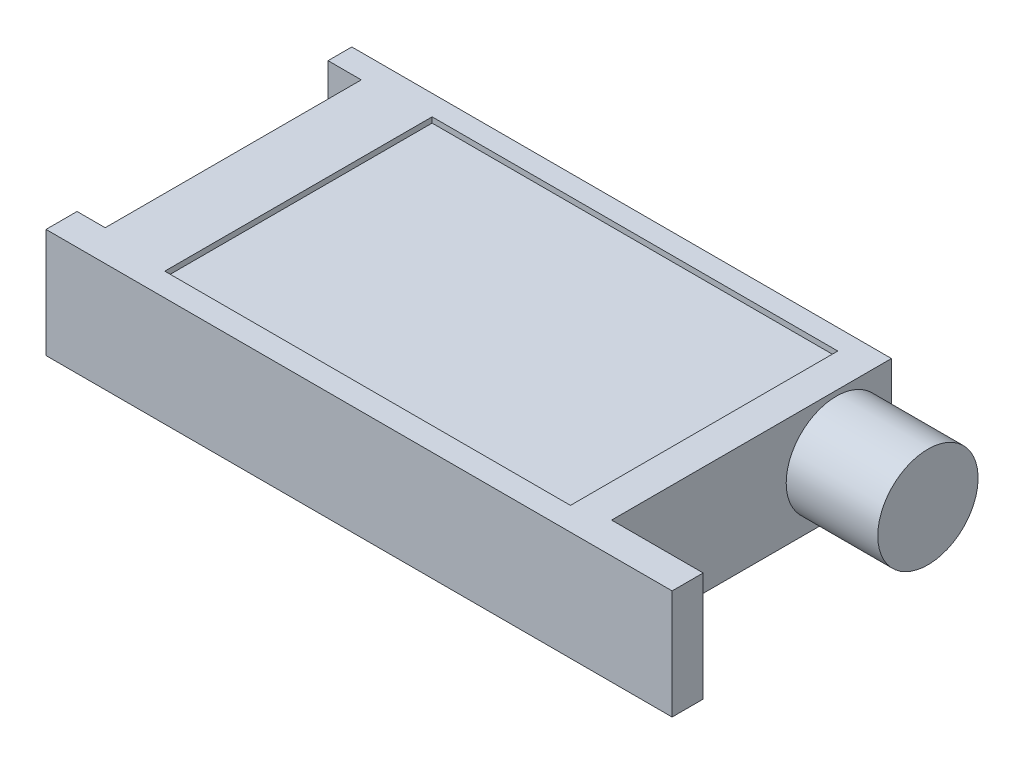
ISO-10303-21;
HEADER;
FILE_DESCRIPTION(('STEP AP214'),'2;1');
FILE_NAME('part.step','',(''),(''),'','','');
FILE_SCHEMA(('AUTOMOTIVE_DESIGN { 1 0 10303 214 1 1 1 1 }'));
ENDSEC;
DATA;
#1=APPLICATION_CONTEXT('core data for automotive mechanical design processes');
#2=APPLICATION_PROTOCOL_DEFINITION('international standard','automotive_design',2000,#1);
#3=PRODUCT_CONTEXT('',#1,'mechanical');
#4=PRODUCT('Part','Part','',(#3));
#5=PRODUCT_RELATED_PRODUCT_CATEGORY('part','',(#4));
#6=PRODUCT_DEFINITION_FORMATION('','',#4);
#7=PRODUCT_DEFINITION_CONTEXT('part definition',#1,'design');
#8=PRODUCT_DEFINITION('design','',#6,#7);
#9=PRODUCT_DEFINITION_SHAPE('','',#8);
#10=(LENGTH_UNIT() NAMED_UNIT(*) SI_UNIT(.MILLI.,.METRE.));
#11=(NAMED_UNIT(*) PLANE_ANGLE_UNIT() SI_UNIT($,.RADIAN.));
#12=(NAMED_UNIT(*) SI_UNIT($,.STERADIAN.) SOLID_ANGLE_UNIT());
#13=UNCERTAINTY_MEASURE_WITH_UNIT(LENGTH_MEASURE(1.E-05),#10,'distance_accuracy_value','');
#14=(GEOMETRIC_REPRESENTATION_CONTEXT(3) GLOBAL_UNCERTAINTY_ASSIGNED_CONTEXT((#13)) GLOBAL_UNIT_ASSIGNED_CONTEXT((#10,
#11,#12)) REPRESENTATION_CONTEXT('',''));
#15=CARTESIAN_POINT('',(0.,0.,0.));
#16=DIRECTION('',(0.,0.,1.));
#17=DIRECTION('',(1.,0.,0.));
#18=AXIS2_PLACEMENT_3D('',#15,#16,#17);
#19=CARTESIAN_POINT('',(42.6292577103097,20.,-25.999180786485));
#20=DIRECTION('',(-1.,0.,0.));
#21=DIRECTION('',(0.,0.,1.));
#22=AXIS2_PLACEMENT_3D('',#19,#20,#21);
#23=PLANE('',#22);
#24=DIRECTION('',(0.,0.,-1.));
#25=VECTOR('',#24,1.);
#26=CARTESIAN_POINT('',(42.6292577103097,0.,-25.999180786485));
#27=LINE('',#26,#25);
#28=CARTESIAN_POINT('',(42.6292577103097,0.,25.2261799674478));
#29=VERTEX_POINT('',#28);
#30=CARTESIAN_POINT('',(42.6292577103097,0.,-25.999180786485));
#31=VERTEX_POINT('',#30);
#32=EDGE_CURVE('E98',#29,#31,#27,.T.);
#33=ORIENTED_EDGE('',*,*,#32,.T.);
#34=DIRECTION('',(0.,-1.,0.));
#35=VECTOR('',#34,1.);
#36=CARTESIAN_POINT('',(42.6292577103097,20.,-25.999180786485));
#37=LINE('',#36,#35);
#38=CARTESIAN_POINT('',(42.6292577103097,20.,-25.999180786485));
#39=VERTEX_POINT('',#38);
#40=EDGE_CURVE('E155',#39,#31,#37,.T.);
#41=ORIENTED_EDGE('',*,*,#40,.F.);
#42=DIRECTION('',(0.,0.,-1.));
#43=VECTOR('',#42,1.);
#44=CARTESIAN_POINT('',(42.6292577103097,20.,-25.999180786485));
#45=LINE('',#44,#43);
#46=CARTESIAN_POINT('',(42.6292577103097,20.,25.2261799674478));
#47=VERTEX_POINT('',#46);
#48=EDGE_CURVE('E153',#47,#39,#45,.T.);
#49=ORIENTED_EDGE('',*,*,#48,.F.);
#50=DIRECTION('',(0.,-1.,0.));
#51=VECTOR('',#50,1.);
#52=CARTESIAN_POINT('',(42.6292577103097,20.,25.2261799674478));
#53=LINE('',#52,#51);
#54=EDGE_CURVE('E149',#47,#29,#53,.T.);
#55=ORIENTED_EDGE('',*,*,#54,.T.);
#56=EDGE_LOOP('',(#33,#41,#49,#55));
#57=FACE_BOUND('',#56,.T.);
#58=CARTESIAN_POINT('',(42.6292577103097,9.88869004447679,-15.9112823228043));
#59=DIRECTION('',(-1.,0.,0.));
#60=DIRECTION('',(0.,0.,1.));
#61=AXIS2_PLACEMENT_3D('',#58,#59,#60);
#62=CIRCLE('',#61,9.1809488573834);
#63=CARTESIAN_POINT('',(42.6292577103097,9.88869004447679,-6.73033346542085));
#64=VERTEX_POINT('',#63);
#65=EDGE_CURVE('E11',#64,#64,#62,.F.);
#66=ORIENTED_EDGE('',*,*,#65,.F.);
#67=EDGE_LOOP('',(#66));
#68=FACE_BOUND('',#67,.T.);
#69=ADVANCED_FACE('F33',(#57,#68),#23,.F.);
#70=CARTESIAN_POINT('',(-56.1421612977568,20.,-25.999180786485));
#71=DIRECTION('',(1.,0.,0.));
#72=DIRECTION('',(0.,0.,-1.));
#73=AXIS2_PLACEMENT_3D('',#70,#71,#72);
#74=PLANE('',#73);
#75=DIRECTION('',(0.,0.,1.));
#76=VECTOR('',#75,1.);
#77=CARTESIAN_POINT('',(-56.1421612977568,0.,-25.999180786485));
#78=LINE('',#77,#76);
#79=CARTESIAN_POINT('',(-56.1421612977568,0.,-25.999180786485));
#80=VERTEX_POINT('',#79);
#81=CARTESIAN_POINT('',(-56.1421612977568,0.,-21.6468898956184));
#82=VERTEX_POINT('',#81);
#83=EDGE_CURVE('E159',#80,#82,#78,.T.);
#84=ORIENTED_EDGE('',*,*,#83,.T.);
#85=DIRECTION('',(0.,-1.,0.));
#86=VECTOR('',#85,1.);
#87=CARTESIAN_POINT('',(-56.1421612977568,20.,-21.6468898956184));
#88=LINE('',#87,#86);
#89=CARTESIAN_POINT('',(-56.1421612977568,20.,-21.6468898956184));
#90=VERTEX_POINT('',#89);
#91=EDGE_CURVE('E194',#90,#82,#88,.T.);
#92=ORIENTED_EDGE('',*,*,#91,.F.);
#93=DIRECTION('',(0.,0.,1.));
#94=VECTOR('',#93,1.);
#95=CARTESIAN_POINT('',(-56.1421612977568,20.,-25.999180786485));
#96=LINE('',#95,#94);
#97=CARTESIAN_POINT('',(-56.1421612977568,20.,-25.999180786485));
#98=VERTEX_POINT('',#97);
#99=EDGE_CURVE('E106',#98,#90,#96,.T.);
#100=ORIENTED_EDGE('',*,*,#99,.F.);
#101=DIRECTION('',(0.,-1.,0.));
#102=VECTOR('',#101,1.);
#103=CARTESIAN_POINT('',(-56.1421612977568,20.,-25.999180786485));
#104=LINE('',#103,#102);
#105=EDGE_CURVE('E41',#98,#80,#104,.T.);
#106=ORIENTED_EDGE('',*,*,#105,.T.);
#107=EDGE_LOOP('',(#84,#92,#100,#106));
#108=FACE_BOUND('',#107,.T.);
#109=ADVANCED_FACE('F35',(#108),#74,.F.);
#110=CARTESIAN_POINT('',(-56.1421612977568,20.,-21.6468898956184));
#111=DIRECTION('',(0.,0.,-1.));
#112=DIRECTION('',(-1.,0.,0.));
#113=AXIS2_PLACEMENT_3D('',#110,#111,#112);
#114=PLANE('',#113);
#115=DIRECTION('',(1.,0.,0.));
#116=VECTOR('',#115,1.);
#117=CARTESIAN_POINT('',(-56.1421612977568,0.,-21.6468898956184));
#118=LINE('',#117,#116);
#119=CARTESIAN_POINT('',(-50.0551461637357,0.,-21.6468898956184));
#120=VERTEX_POINT('',#119);
#121=EDGE_CURVE('E161',#82,#120,#118,.T.);
#122=ORIENTED_EDGE('',*,*,#121,.T.);
#123=DIRECTION('',(0.,-1.,0.));
#124=VECTOR('',#123,1.);
#125=CARTESIAN_POINT('',(-50.0551461637357,20.,-21.6468898956184));
#126=LINE('',#125,#124);
#127=CARTESIAN_POINT('',(-50.0551461637357,20.,-21.6468898956184));
#128=VERTEX_POINT('',#127);
#129=EDGE_CURVE('E191',#128,#120,#126,.T.);
#130=ORIENTED_EDGE('',*,*,#129,.F.);
#131=DIRECTION('',(1.,0.,0.));
#132=VECTOR('',#131,1.);
#133=CARTESIAN_POINT('',(-56.1421612977568,20.,-21.6468898956184));
#134=LINE('',#133,#132);
#135=EDGE_CURVE('E215',#90,#128,#134,.T.);
#136=ORIENTED_EDGE('',*,*,#135,.F.);
#137=ORIENTED_EDGE('',*,*,#91,.T.);
#138=EDGE_LOOP('',(#122,#130,#136,#137));
#139=FACE_BOUND('',#138,.T.);
#140=ADVANCED_FACE('F206',(#139),#114,.F.);
#141=CARTESIAN_POINT('',(-50.0551461637357,20.,-21.6468898956184));
#142=DIRECTION('',(1.,0.,0.));
#143=DIRECTION('',(0.,0.,-1.));
#144=AXIS2_PLACEMENT_3D('',#141,#142,#143);
#145=PLANE('',#144);
#146=DIRECTION('',(0.,0.,1.));
#147=VECTOR('',#146,1.);
#148=CARTESIAN_POINT('',(-50.0551461637357,0.,-21.6468898956184));
#149=LINE('',#148,#147);
#150=CARTESIAN_POINT('',(-50.0551461637357,0.,25.2261799674478));
#151=VERTEX_POINT('',#150);
#152=EDGE_CURVE('E164',#120,#151,#149,.T.);
#153=ORIENTED_EDGE('',*,*,#152,.T.);
#154=DIRECTION('',(0.,-1.,0.));
#155=VECTOR('',#154,1.);
#156=CARTESIAN_POINT('',(-50.0551461637357,20.,25.2261799674478));
#157=LINE('',#156,#155);
#158=CARTESIAN_POINT('',(-50.0551461637357,20.,25.2261799674478));
#159=VERTEX_POINT('',#158);
#160=EDGE_CURVE('E188',#159,#151,#157,.T.);
#161=ORIENTED_EDGE('',*,*,#160,.F.);
#162=DIRECTION('',(0.,0.,1.));
#163=VECTOR('',#162,1.);
#164=CARTESIAN_POINT('',(-50.0551461637357,20.,-21.6468898956184));
#165=LINE('',#164,#163);
#166=EDGE_CURVE('E212',#128,#159,#165,.T.);
#167=ORIENTED_EDGE('',*,*,#166,.F.);
#168=ORIENTED_EDGE('',*,*,#129,.T.);
#169=EDGE_LOOP('',(#153,#161,#167,#168));
#170=FACE_BOUND('',#169,.T.);
#171=ADVANCED_FACE('F210',(#170),#145,.F.);
#172=CARTESIAN_POINT('',(-55.206550944412,20.,25.2261799674478));
#173=DIRECTION('',(0.,0.,1.));
#174=DIRECTION('',(1.,0.,0.));
#175=AXIS2_PLACEMENT_3D('',#172,#173,#174);
#176=PLANE('',#175);
#177=DIRECTION('',(-1.,0.,0.));
#178=VECTOR('',#177,1.);
#179=CARTESIAN_POINT('',(-55.206550944412,0.,25.2261799674478));
#180=LINE('',#179,#178);
#181=CARTESIAN_POINT('',(-55.206550944412,0.,25.2261799674478));
#182=VERTEX_POINT('',#181);
#183=EDGE_CURVE('E166',#151,#182,#180,.T.);
#184=ORIENTED_EDGE('',*,*,#183,.T.);
#185=DIRECTION('',(0.,-1.,0.));
#186=VECTOR('',#185,1.);
#187=CARTESIAN_POINT('',(-55.206550944412,20.,25.2261799674478));
#188=LINE('',#187,#186);
#189=CARTESIAN_POINT('',(-55.206550944412,20.,25.2261799674478));
#190=VERTEX_POINT('',#189);
#191=EDGE_CURVE('E185',#190,#182,#188,.T.);
#192=ORIENTED_EDGE('',*,*,#191,.F.);
#193=DIRECTION('',(-1.,0.,0.));
#194=VECTOR('',#193,1.);
#195=CARTESIAN_POINT('',(-55.206550944412,20.,25.2261799674478));
#196=LINE('',#195,#194);
#197=EDGE_CURVE('E214',#159,#190,#196,.T.);
#198=ORIENTED_EDGE('',*,*,#197,.F.);
#199=ORIENTED_EDGE('',*,*,#160,.T.);
#200=EDGE_LOOP('',(#184,#192,#198,#199));
#201=FACE_BOUND('',#200,.T.);
#202=ADVANCED_FACE('F321',(#201),#176,.F.);
#203=CARTESIAN_POINT('',(-55.206550944412,20.,30.9105426141656));
#204=DIRECTION('',(1.,0.,0.));
#205=DIRECTION('',(0.,0.,-1.));
#206=AXIS2_PLACEMENT_3D('',#203,#204,#205);
#207=PLANE('',#206);
#208=DIRECTION('',(0.,0.,1.));
#209=VECTOR('',#208,1.);
#210=CARTESIAN_POINT('',(-55.206550944412,0.,30.9105426141656));
#211=LINE('',#210,#209);
#212=CARTESIAN_POINT('',(-55.206550944412,0.,30.9105426141656));
#213=VERTEX_POINT('',#212);
#214=EDGE_CURVE('E168',#182,#213,#211,.T.);
#215=ORIENTED_EDGE('',*,*,#214,.T.);
#216=DIRECTION('',(0.,-1.,0.));
#217=VECTOR('',#216,1.);
#218=CARTESIAN_POINT('',(-55.206550944412,20.,30.9105426141656));
#219=LINE('',#218,#217);
#220=CARTESIAN_POINT('',(-55.206550944412,20.,30.9105426141656));
#221=VERTEX_POINT('',#220);
#222=EDGE_CURVE('E182',#221,#213,#219,.T.);
#223=ORIENTED_EDGE('',*,*,#222,.F.);
#224=DIRECTION('',(0.,0.,1.));
#225=VECTOR('',#224,1.);
#226=CARTESIAN_POINT('',(-55.206550944412,20.,30.9105426141656));
#227=LINE('',#226,#225);
#228=EDGE_CURVE('E217',#190,#221,#227,.T.);
#229=ORIENTED_EDGE('',*,*,#228,.F.);
#230=ORIENTED_EDGE('',*,*,#191,.T.);
#231=EDGE_LOOP('',(#215,#223,#229,#230));
#232=FACE_BOUND('',#231,.T.);
#233=ADVANCED_FACE('F226',(#232),#207,.F.);
#234=CARTESIAN_POINT('',(59.3918124957771,20.,30.9105426141656));
#235=DIRECTION('',(0.,0.,-1.));
#236=DIRECTION('',(-1.,0.,0.));
#237=AXIS2_PLACEMENT_3D('',#234,#235,#236);
#238=PLANE('',#237);
#239=DIRECTION('',(1.,0.,0.));
#240=VECTOR('',#239,1.);
#241=CARTESIAN_POINT('',(59.3918124957771,0.,30.9105426141656));
#242=LINE('',#241,#240);
#243=CARTESIAN_POINT('',(59.3918124957771,0.,30.9105426141656));
#244=VERTEX_POINT('',#243);
#245=EDGE_CURVE('E171',#213,#244,#242,.T.);
#246=ORIENTED_EDGE('',*,*,#245,.T.);
#247=DIRECTION('',(0.,-1.,0.));
#248=VECTOR('',#247,1.);
#249=CARTESIAN_POINT('',(59.3918124957771,20.,30.9105426141656));
#250=LINE('',#249,#248);
#251=CARTESIAN_POINT('',(59.3918124957771,20.,30.9105426141656));
#252=VERTEX_POINT('',#251);
#253=EDGE_CURVE('E148',#252,#244,#250,.T.);
#254=ORIENTED_EDGE('',*,*,#253,.F.);
#255=DIRECTION('',(1.,0.,0.));
#256=VECTOR('',#255,1.);
#257=CARTESIAN_POINT('',(-31.6218630620355,20.,30.9105426141656));
#258=LINE('',#257,#256);
#259=EDGE_CURVE('E136',#221,#252,#258,.T.);
#260=ORIENTED_EDGE('',*,*,#259,.F.);
#261=ORIENTED_EDGE('',*,*,#222,.T.);
#262=EDGE_LOOP('',(#246,#254,#260,#261));
#263=FACE_BOUND('',#262,.T.);
#264=ADVANCED_FACE('F229',(#263),#238,.F.);
#265=CARTESIAN_POINT('',(59.3918124957771,20.,25.2261799674478));
#266=DIRECTION('',(-1.,0.,0.));
#267=DIRECTION('',(0.,0.,1.));
#268=AXIS2_PLACEMENT_3D('',#265,#266,#267);
#269=PLANE('',#268);
#270=DIRECTION('',(0.,0.,-1.));
#271=VECTOR('',#270,1.);
#272=CARTESIAN_POINT('',(59.3918124957771,0.,25.2261799674478));
#273=LINE('',#272,#271);
#274=CARTESIAN_POINT('',(59.3918124957771,0.,25.2261799674478));
#275=VERTEX_POINT('',#274);
#276=EDGE_CURVE('E145',#244,#275,#273,.T.);
#277=ORIENTED_EDGE('',*,*,#276,.T.);
#278=DIRECTION('',(0.,-1.,0.));
#279=VECTOR('',#278,1.);
#280=CARTESIAN_POINT('',(59.3918124957771,20.,25.2261799674478));
#281=LINE('',#280,#279);
#282=CARTESIAN_POINT('',(59.3918124957771,20.,25.2261799674478));
#283=VERTEX_POINT('',#282);
#284=EDGE_CURVE('E142',#283,#275,#281,.T.);
#285=ORIENTED_EDGE('',*,*,#284,.F.);
#286=DIRECTION('',(0.,0.,-1.));
#287=VECTOR('',#286,1.);
#288=CARTESIAN_POINT('',(59.3918124957771,20.,25.2261799674478));
#289=LINE('',#288,#287);
#290=EDGE_CURVE('E129',#252,#283,#289,.T.);
#291=ORIENTED_EDGE('',*,*,#290,.F.);
#292=ORIENTED_EDGE('',*,*,#253,.T.);
#293=EDGE_LOOP('',(#277,#285,#291,#292));
#294=FACE_BOUND('',#293,.T.);
#295=ADVANCED_FACE('F143',(#294),#269,.F.);
#296=CARTESIAN_POINT('',(42.6292577103097,20.,25.2261799674478));
#297=DIRECTION('',(0.,0.,1.));
#298=DIRECTION('',(1.,0.,0.));
#299=AXIS2_PLACEMENT_3D('',#296,#297,#298);
#300=PLANE('',#299);
#301=DIRECTION('',(-1.,0.,0.));
#302=VECTOR('',#301,1.);
#303=CARTESIAN_POINT('',(42.6292577103097,0.,25.2261799674478));
#304=LINE('',#303,#302);
#305=EDGE_CURVE('E174',#275,#29,#304,.T.);
#306=ORIENTED_EDGE('',*,*,#305,.T.);
#307=ORIENTED_EDGE('',*,*,#54,.F.);
#308=DIRECTION('',(-1.,0.,0.));
#309=VECTOR('',#308,1.);
#310=CARTESIAN_POINT('',(42.6292577103097,20.,25.2261799674478));
#311=LINE('',#310,#309);
#312=EDGE_CURVE('E133',#283,#47,#311,.T.);
#313=ORIENTED_EDGE('',*,*,#312,.F.);
#314=ORIENTED_EDGE('',*,*,#284,.T.);
#315=EDGE_LOOP('',(#306,#307,#313,#314));
#316=FACE_BOUND('',#315,.T.);
#317=ADVANCED_FACE('F151',(#316),#300,.F.);
#318=CARTESIAN_POINT('',(-46.6564064796984,20.,-25.999180786485));
#319=DIRECTION('',(0.,0.,1.));
#320=DIRECTION('',(1.,0.,0.));
#321=AXIS2_PLACEMENT_3D('',#318,#319,#320);
#322=PLANE('',#321);
#323=DIRECTION('',(-1.,0.,0.));
#324=VECTOR('',#323,1.);
#325=CARTESIAN_POINT('',(-46.6564064796984,0.,-25.999180786485));
#326=LINE('',#325,#324);
#327=EDGE_CURVE('E177',#31,#80,#326,.T.);
#328=ORIENTED_EDGE('',*,*,#327,.T.);
#329=ORIENTED_EDGE('',*,*,#105,.F.);
#330=DIRECTION('',(-1.,0.,0.));
#331=VECTOR('',#330,1.);
#332=CARTESIAN_POINT('',(-46.6564064796984,20.,-25.999180786485));
#333=LINE('',#332,#331);
#334=EDGE_CURVE('E57',#39,#98,#333,.T.);
#335=ORIENTED_EDGE('',*,*,#334,.F.);
#336=ORIENTED_EDGE('',*,*,#40,.T.);
#337=EDGE_LOOP('',(#328,#329,#335,#336));
#338=FACE_BOUND('',#337,.T.);
#339=ADVANCED_FACE('F197',(#338),#322,.F.);
#340=CARTESIAN_POINT('',(0.,20.,0.));
#341=DIRECTION('',(0.,1.,0.));
#342=DIRECTION('',(0.,0.,1.));
#343=AXIS2_PLACEMENT_3D('',#340,#341,#342);
#344=PLANE('',#343);
#345=DIRECTION('',(0.,0.,1.));
#346=VECTOR('',#345,1.);
#347=CARTESIAN_POINT('',(-37.7177348477957,20.,-22.2718241691098));
#348=LINE('',#347,#346);
#349=CARTESIAN_POINT('',(-37.7177348477957,20.,-22.2718241691098));
#350=VERTEX_POINT('',#349);
#351=CARTESIAN_POINT('',(-37.7177348477957,20.,26.6601252081671));
#352=VERTEX_POINT('',#351);
#353=EDGE_CURVE('E48',#350,#352,#348,.T.);
#354=ORIENTED_EDGE('',*,*,#353,.F.);
#355=DIRECTION('',(-1.,0.,0.));
#356=VECTOR('',#355,1.);
#357=CARTESIAN_POINT('',(-37.7177348477957,20.,-22.2718241691098));
#358=LINE('',#357,#356);
#359=CARTESIAN_POINT('',(36.53220819929,20.,-22.2718241691098));
#360=VERTEX_POINT('',#359);
#361=EDGE_CURVE('E246',#360,#350,#358,.T.);
#362=ORIENTED_EDGE('',*,*,#361,.F.);
#363=DIRECTION('',(0.,0.,-1.));
#364=VECTOR('',#363,1.);
#365=CARTESIAN_POINT('',(36.53220819929,20.,-22.2718241691098));
#366=LINE('',#365,#364);
#367=CARTESIAN_POINT('',(36.53220819929,20.,26.6601252081671));
#368=VERTEX_POINT('',#367);
#369=EDGE_CURVE('E250',#368,#360,#366,.T.);
#370=ORIENTED_EDGE('',*,*,#369,.F.);
#371=DIRECTION('',(1.,0.,0.));
#372=VECTOR('',#371,1.);
#373=CARTESIAN_POINT('',(-37.7177348477957,20.,26.6601252081671));
#374=LINE('',#373,#372);
#375=EDGE_CURVE('E253',#352,#368,#374,.T.);
#376=ORIENTED_EDGE('',*,*,#375,.F.);
#377=EDGE_LOOP('',(#354,#362,#370,#376));
#378=FACE_BOUND('',#377,.T.);
#379=ORIENTED_EDGE('',*,*,#334,.T.);
#380=ORIENTED_EDGE('',*,*,#99,.T.);
#381=ORIENTED_EDGE('',*,*,#135,.T.);
#382=ORIENTED_EDGE('',*,*,#166,.T.);
#383=ORIENTED_EDGE('',*,*,#197,.T.);
#384=ORIENTED_EDGE('',*,*,#228,.T.);
#385=ORIENTED_EDGE('',*,*,#259,.T.);
#386=ORIENTED_EDGE('',*,*,#290,.T.);
#387=ORIENTED_EDGE('',*,*,#312,.T.);
#388=ORIENTED_EDGE('',*,*,#48,.T.);
#389=EDGE_LOOP('',(#379,#380,#381,#382,#383,#384,#385,#386,#387,#388));
#390=FACE_BOUND('',#389,.T.);
#391=ADVANCED_FACE('F131',(#378,#390),#344,.T.);
#392=CARTESIAN_POINT('',(0.,0.,0.));
#393=DIRECTION('',(0.,1.,0.));
#394=DIRECTION('',(0.,0.,1.));
#395=AXIS2_PLACEMENT_3D('',#392,#393,#394);
#396=PLANE('',#395);
#397=ORIENTED_EDGE('',*,*,#83,.F.);
#398=ORIENTED_EDGE('',*,*,#327,.F.);
#399=ORIENTED_EDGE('',*,*,#32,.F.);
#400=ORIENTED_EDGE('',*,*,#305,.F.);
#401=ORIENTED_EDGE('',*,*,#276,.F.);
#402=ORIENTED_EDGE('',*,*,#245,.F.);
#403=ORIENTED_EDGE('',*,*,#214,.F.);
#404=ORIENTED_EDGE('',*,*,#183,.F.);
#405=ORIENTED_EDGE('',*,*,#152,.F.);
#406=ORIENTED_EDGE('',*,*,#121,.F.);
#407=EDGE_LOOP('',(#397,#398,#399,#400,#401,#402,#403,#404,#405,#406));
#408=FACE_BOUND('',#407,.T.);
#409=ADVANCED_FACE('F201',(#408),#396,.F.);
#410=CARTESIAN_POINT('',(85.3594572749078,9.88869004447679,-15.9112823228043));
#411=DIRECTION('',(-1.,0.,0.));
#412=DIRECTION('',(0.,0.,1.));
#413=AXIS2_PLACEMENT_3D('',#410,#411,#412);
#414=CYLINDRICAL_SURFACE('',#413,9.1809488573834);
#415=CARTESIAN_POINT('',(59.3918124957771,9.88869004447679,-15.9112823228043));
#416=DIRECTION('',(-1.,0.,0.));
#417=DIRECTION('',(0.,0.,1.));
#418=AXIS2_PLACEMENT_3D('',#415,#416,#417);
#419=CIRCLE('',#418,9.1809488573834);
#420=CARTESIAN_POINT('',(59.3918124957771,9.88869004447679,-6.73033346542085));
#421=VERTEX_POINT('',#420);
#422=EDGE_CURVE('E162',#421,#421,#419,.T.);
#423=ORIENTED_EDGE('',*,*,#422,.T.);
#424=EDGE_LOOP('',(#423));
#425=FACE_BOUND('',#424,.T.);
#426=ORIENTED_EDGE('',*,*,#65,.T.);
#427=EDGE_LOOP('',(#426));
#428=FACE_BOUND('',#427,.T.);
#429=ADVANCED_FACE('F374',(#425,#428),#414,.T.);
#430=CARTESIAN_POINT('',(59.3918124957771,20.,25.2261799674478));
#431=DIRECTION('',(-1.,0.,0.));
#432=DIRECTION('',(0.,0.,1.));
#433=AXIS2_PLACEMENT_3D('',#430,#431,#432);
#434=PLANE('',#433);
#435=ORIENTED_EDGE('',*,*,#422,.F.);
#436=EDGE_LOOP('',(#435));
#437=FACE_BOUND('',#436,.T.);
#438=ADVANCED_FACE('F380',(#437),#434,.F.);
#439=CARTESIAN_POINT('',(-37.7177348477957,19.,-22.2718241691098));
#440=DIRECTION('',(-1.,0.,0.));
#441=DIRECTION('',(0.,0.,1.));
#442=AXIS2_PLACEMENT_3D('',#439,#440,#441);
#443=PLANE('',#442);
#444=ORIENTED_EDGE('',*,*,#353,.T.);
#445=DIRECTION('',(0.,1.,0.));
#446=VECTOR('',#445,1.);
#447=CARTESIAN_POINT('',(-37.7177348477957,19.,26.6601252081671));
#448=LINE('',#447,#446);
#449=CARTESIAN_POINT('',(-37.7177348477957,19.,26.6601252081671));
#450=VERTEX_POINT('',#449);
#451=EDGE_CURVE('E236',#450,#352,#448,.T.);
#452=ORIENTED_EDGE('',*,*,#451,.F.);
#453=DIRECTION('',(0.,0.,1.));
#454=VECTOR('',#453,1.);
#455=CARTESIAN_POINT('',(-37.7177348477957,19.,-22.2718241691098));
#456=LINE('',#455,#454);
#457=CARTESIAN_POINT('',(-37.7177348477957,19.,-22.2718241691098));
#458=VERTEX_POINT('',#457);
#459=EDGE_CURVE('E249',#458,#450,#456,.T.);
#460=ORIENTED_EDGE('',*,*,#459,.F.);
#461=DIRECTION('',(0.,1.,0.));
#462=VECTOR('',#461,1.);
#463=CARTESIAN_POINT('',(-37.7177348477957,19.,-22.2718241691098));
#464=LINE('',#463,#462);
#465=EDGE_CURVE('E235',#458,#350,#464,.T.);
#466=ORIENTED_EDGE('',*,*,#465,.T.);
#467=EDGE_LOOP('',(#444,#452,#460,#466));
#468=FACE_BOUND('',#467,.T.);
#469=ADVANCED_FACE('F274',(#468),#443,.F.);
#470=CARTESIAN_POINT('',(-37.7177348477957,19.,-22.2718241691098));
#471=DIRECTION('',(0.,0.,-1.));
#472=DIRECTION('',(-1.,0.,0.));
#473=AXIS2_PLACEMENT_3D('',#470,#471,#472);
#474=PLANE('',#473);
#475=ORIENTED_EDGE('',*,*,#361,.T.);
#476=ORIENTED_EDGE('',*,*,#465,.F.);
#477=DIRECTION('',(-1.,0.,0.));
#478=VECTOR('',#477,1.);
#479=CARTESIAN_POINT('',(-37.7177348477957,19.,-22.2718241691098));
#480=LINE('',#479,#478);
#481=CARTESIAN_POINT('',(36.53220819929,19.,-22.2718241691098));
#482=VERTEX_POINT('',#481);
#483=EDGE_CURVE('E239',#482,#458,#480,.T.);
#484=ORIENTED_EDGE('',*,*,#483,.F.);
#485=DIRECTION('',(0.,1.,0.));
#486=VECTOR('',#485,1.);
#487=CARTESIAN_POINT('',(36.53220819929,19.,-22.2718241691098));
#488=LINE('',#487,#486);
#489=EDGE_CURVE('E242',#482,#360,#488,.T.);
#490=ORIENTED_EDGE('',*,*,#489,.T.);
#491=EDGE_LOOP('',(#475,#476,#484,#490));
#492=FACE_BOUND('',#491,.T.);
#493=ADVANCED_FACE('F285',(#492),#474,.F.);
#494=CARTESIAN_POINT('',(36.53220819929,19.,-22.2718241691098));
#495=DIRECTION('',(1.,0.,0.));
#496=DIRECTION('',(0.,0.,-1.));
#497=AXIS2_PLACEMENT_3D('',#494,#495,#496);
#498=PLANE('',#497);
#499=ORIENTED_EDGE('',*,*,#369,.T.);
#500=ORIENTED_EDGE('',*,*,#489,.F.);
#501=DIRECTION('',(0.,0.,-1.));
#502=VECTOR('',#501,1.);
#503=CARTESIAN_POINT('',(36.53220819929,19.,-22.2718241691098));
#504=LINE('',#503,#502);
#505=CARTESIAN_POINT('',(36.53220819929,19.,26.6601252081671));
#506=VERTEX_POINT('',#505);
#507=EDGE_CURVE('E259',#506,#482,#504,.T.);
#508=ORIENTED_EDGE('',*,*,#507,.F.);
#509=DIRECTION('',(0.,1.,0.));
#510=VECTOR('',#509,1.);
#511=CARTESIAN_POINT('',(36.53220819929,19.,26.6601252081671));
#512=LINE('',#511,#510);
#513=EDGE_CURVE('E238',#506,#368,#512,.T.);
#514=ORIENTED_EDGE('',*,*,#513,.T.);
#515=EDGE_LOOP('',(#499,#500,#508,#514));
#516=FACE_BOUND('',#515,.T.);
#517=ADVANCED_FACE('F290',(#516),#498,.F.);
#518=CARTESIAN_POINT('',(-37.7177348477957,19.,26.6601252081671));
#519=DIRECTION('',(0.,0.,1.));
#520=DIRECTION('',(1.,0.,0.));
#521=AXIS2_PLACEMENT_3D('',#518,#519,#520);
#522=PLANE('',#521);
#523=ORIENTED_EDGE('',*,*,#375,.T.);
#524=ORIENTED_EDGE('',*,*,#513,.F.);
#525=DIRECTION('',(1.,0.,0.));
#526=VECTOR('',#525,1.);
#527=CARTESIAN_POINT('',(-37.7177348477957,19.,26.6601252081671));
#528=LINE('',#527,#526);
#529=EDGE_CURVE('E262',#450,#506,#528,.T.);
#530=ORIENTED_EDGE('',*,*,#529,.F.);
#531=ORIENTED_EDGE('',*,*,#451,.T.);
#532=EDGE_LOOP('',(#523,#524,#530,#531));
#533=FACE_BOUND('',#532,.T.);
#534=ADVANCED_FACE('F295',(#533),#522,.F.);
#535=CARTESIAN_POINT('',(0.,19.,0.));
#536=DIRECTION('',(0.,1.,0.));
#537=DIRECTION('',(0.,0.,1.));
#538=AXIS2_PLACEMENT_3D('',#535,#536,#537);
#539=PLANE('',#538);
#540=ORIENTED_EDGE('',*,*,#459,.T.);
#541=ORIENTED_EDGE('',*,*,#529,.T.);
#542=ORIENTED_EDGE('',*,*,#507,.T.);
#543=ORIENTED_EDGE('',*,*,#483,.T.);
#544=EDGE_LOOP('',(#540,#541,#542,#543));
#545=FACE_BOUND('',#544,.T.);
#546=ADVANCED_FACE('F269',(#545),#539,.T.);
#547=CLOSED_SHELL('',(#69,#109,#140,#171,#202,#233,#264,#295,#317,#339,#391,#409,#429,#438,#469,
#493,#517,#534,#546));
#548=MANIFOLD_SOLID_BREP('B2',#547);
#549=ADVANCED_BREP_SHAPE_REPRESENTATION('',(#18,#548),#14);
#550=SHAPE_DEFINITION_REPRESENTATION(#9,#549);
ENDSEC;
END-ISO-10303-21;
